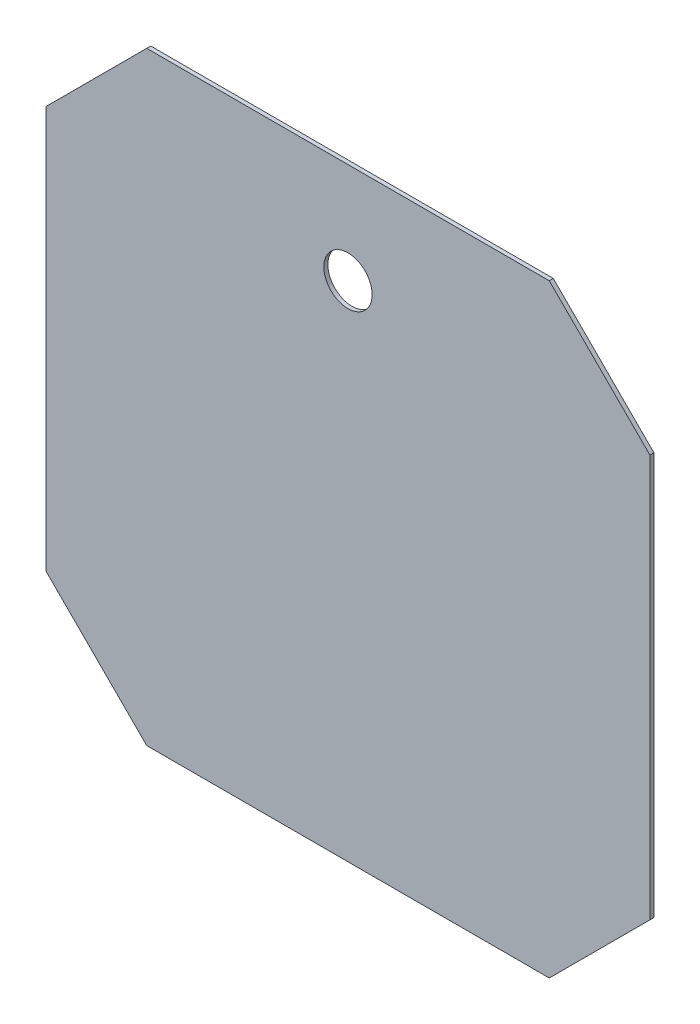
ISO-10303-21;
HEADER;
FILE_DESCRIPTION(('STEP AP214'),'2;1');
FILE_NAME('part.step','',(''),(''),'','','');
FILE_SCHEMA(('AUTOMOTIVE_DESIGN { 1 0 10303 214 1 1 1 1 }'));
ENDSEC;
DATA;
#1=APPLICATION_CONTEXT('core data for automotive mechanical design processes');
#2=APPLICATION_PROTOCOL_DEFINITION('international standard','automotive_design',2000,#1);
#3=PRODUCT_CONTEXT('',#1,'mechanical');
#4=PRODUCT('Part','Part','',(#3));
#5=PRODUCT_RELATED_PRODUCT_CATEGORY('part','',(#4));
#6=PRODUCT_DEFINITION_FORMATION('','',#4);
#7=PRODUCT_DEFINITION_CONTEXT('part definition',#1,'design');
#8=PRODUCT_DEFINITION('design','',#6,#7);
#9=PRODUCT_DEFINITION_SHAPE('','',#8);
#10=(LENGTH_UNIT() NAMED_UNIT(*) SI_UNIT(.MILLI.,.METRE.));
#11=(NAMED_UNIT(*) PLANE_ANGLE_UNIT() SI_UNIT($,.RADIAN.));
#12=(NAMED_UNIT(*) SI_UNIT($,.STERADIAN.) SOLID_ANGLE_UNIT());
#13=UNCERTAINTY_MEASURE_WITH_UNIT(LENGTH_MEASURE(1.E-05),#10,'distance_accuracy_value','');
#14=(GEOMETRIC_REPRESENTATION_CONTEXT(3) GLOBAL_UNCERTAINTY_ASSIGNED_CONTEXT((#13)) GLOBAL_UNIT_ASSIGNED_CONTEXT((#10,
#11,#12)) REPRESENTATION_CONTEXT('',''));
#15=CARTESIAN_POINT('',(0.,0.,0.));
#16=DIRECTION('',(0.,0.,1.));
#17=DIRECTION('',(1.,0.,0.));
#18=AXIS2_PLACEMENT_3D('',#15,#16,#17);
#19=CARTESIAN_POINT('',(0.,0.,1.));
#20=DIRECTION('',(0.,0.,1.));
#21=DIRECTION('',(1.,0.,0.));
#22=AXIS2_PLACEMENT_3D('',#19,#20,#21);
#23=PLANE('',#22);
#24=DIRECTION('',(0.,-1.,0.));
#25=VECTOR('',#24,1.);
#26=CARTESIAN_POINT('',(-75.,49.9999999999997,1.));
#27=LINE('',#26,#25);
#28=CARTESIAN_POINT('',(-75.,49.9999999999997,1.));
#29=VERTEX_POINT('',#28);
#30=CARTESIAN_POINT('',(-75.,-49.9999999999997,1.));
#31=VERTEX_POINT('',#30);
#32=EDGE_CURVE('E146',#29,#31,#27,.T.);
#33=ORIENTED_EDGE('',*,*,#32,.T.);
#34=DIRECTION('',(0.707106781186543,-0.707106781186552,0.));
#35=VECTOR('',#34,1.);
#36=CARTESIAN_POINT('',(-75.,-49.9999999999997,1.));
#37=LINE('',#36,#35);
#38=CARTESIAN_POINT('',(-50.,-75.,1.));
#39=VERTEX_POINT('',#38);
#40=EDGE_CURVE('E94',#31,#39,#37,.T.);
#41=ORIENTED_EDGE('',*,*,#40,.T.);
#42=DIRECTION('',(1.,0.,0.));
#43=VECTOR('',#42,1.);
#44=CARTESIAN_POINT('',(-50.,-75.,1.));
#45=LINE('',#44,#43);
#46=CARTESIAN_POINT('',(50.,-75.,1.));
#47=VERTEX_POINT('',#46);
#48=EDGE_CURVE('E161',#39,#47,#45,.T.);
#49=ORIENTED_EDGE('',*,*,#48,.T.);
#50=DIRECTION('',(0.707106781186543,0.707106781186552,0.));
#51=VECTOR('',#50,1.);
#52=CARTESIAN_POINT('',(75.,-49.9999999999997,1.));
#53=LINE('',#52,#51);
#54=CARTESIAN_POINT('',(75.,-49.9999999999997,1.));
#55=VERTEX_POINT('',#54);
#56=EDGE_CURVE('E174',#47,#55,#53,.T.);
#57=ORIENTED_EDGE('',*,*,#56,.T.);
#58=DIRECTION('',(0.,1.,0.));
#59=VECTOR('',#58,1.);
#60=CARTESIAN_POINT('',(75.,49.9999999999997,1.));
#61=LINE('',#60,#59);
#62=CARTESIAN_POINT('',(75.,49.9999999999997,1.));
#63=VERTEX_POINT('',#62);
#64=EDGE_CURVE('E113',#55,#63,#61,.T.);
#65=ORIENTED_EDGE('',*,*,#64,.T.);
#66=DIRECTION('',(-0.707106781186543,0.707106781186552,0.));
#67=VECTOR('',#66,1.);
#68=CARTESIAN_POINT('',(75.,49.9999999999997,1.));
#69=LINE('',#68,#67);
#70=CARTESIAN_POINT('',(50.,75.,1.));
#71=VERTEX_POINT('',#70);
#72=EDGE_CURVE('E107',#63,#71,#69,.T.);
#73=ORIENTED_EDGE('',*,*,#72,.T.);
#74=DIRECTION('',(-1.,0.,0.));
#75=VECTOR('',#74,1.);
#76=CARTESIAN_POINT('',(-50.,75.,1.));
#77=LINE('',#76,#75);
#78=CARTESIAN_POINT('',(-50.,75.,1.));
#79=VERTEX_POINT('',#78);
#80=EDGE_CURVE('E111',#71,#79,#77,.T.);
#81=ORIENTED_EDGE('',*,*,#80,.T.);
#82=DIRECTION('',(-0.707106781186543,-0.707106781186552,0.));
#83=VECTOR('',#82,1.);
#84=CARTESIAN_POINT('',(-75.,49.9999999999997,1.));
#85=LINE('',#84,#83);
#86=EDGE_CURVE('E51',#79,#29,#85,.T.);
#87=ORIENTED_EDGE('',*,*,#86,.T.);
#88=EDGE_LOOP('',(#33,#41,#49,#57,#65,#73,#81,#87));
#89=FACE_BOUND('',#88,.T.);
#90=CARTESIAN_POINT('',(0.,49.9999999999997,1.));
#91=DIRECTION('',(0.,0.,1.));
#92=DIRECTION('',(1.,0.,0.));
#93=AXIS2_PLACEMENT_3D('',#90,#91,#92);
#94=CIRCLE('',#93,6.);
#95=CARTESIAN_POINT('',(6.,49.9999999999997,1.));
#96=VERTEX_POINT('',#95);
#97=EDGE_CURVE('E135',#96,#96,#94,.T.);
#98=ORIENTED_EDGE('',*,*,#97,.F.);
#99=EDGE_LOOP('',(#98));
#100=FACE_BOUND('',#99,.T.);
#101=ADVANCED_FACE('F34',(#89,#100),#23,.T.);
#102=CARTESIAN_POINT('',(0.,0.,0.));
#103=DIRECTION('',(0.,0.,1.));
#104=DIRECTION('',(1.,0.,0.));
#105=AXIS2_PLACEMENT_3D('',#102,#103,#104);
#106=PLANE('',#105);
#107=DIRECTION('',(0.,-1.,0.));
#108=VECTOR('',#107,1.);
#109=CARTESIAN_POINT('',(-75.,49.9999999999997,0.));
#110=LINE('',#109,#108);
#111=CARTESIAN_POINT('',(-75.,49.9999999999997,0.));
#112=VERTEX_POINT('',#111);
#113=CARTESIAN_POINT('',(-75.,-49.9999999999997,0.));
#114=VERTEX_POINT('',#113);
#115=EDGE_CURVE('E131',#112,#114,#110,.T.);
#116=ORIENTED_EDGE('',*,*,#115,.F.);
#117=DIRECTION('',(-0.707106781186543,-0.707106781186552,0.));
#118=VECTOR('',#117,1.);
#119=CARTESIAN_POINT('',(-75.,49.9999999999997,0.));
#120=LINE('',#119,#118);
#121=CARTESIAN_POINT('',(-50.,75.,0.));
#122=VERTEX_POINT('',#121);
#123=EDGE_CURVE('E86',#122,#112,#120,.T.);
#124=ORIENTED_EDGE('',*,*,#123,.F.);
#125=DIRECTION('',(-1.,0.,0.));
#126=VECTOR('',#125,1.);
#127=CARTESIAN_POINT('',(-50.,75.,0.));
#128=LINE('',#127,#126);
#129=CARTESIAN_POINT('',(50.,75.,0.));
#130=VERTEX_POINT('',#129);
#131=EDGE_CURVE('E80',#130,#122,#128,.T.);
#132=ORIENTED_EDGE('',*,*,#131,.F.);
#133=DIRECTION('',(-0.707106781186543,0.707106781186552,0.));
#134=VECTOR('',#133,1.);
#135=CARTESIAN_POINT('',(75.,49.9999999999997,0.));
#136=LINE('',#135,#134);
#137=CARTESIAN_POINT('',(75.,49.9999999999997,0.));
#138=VERTEX_POINT('',#137);
#139=EDGE_CURVE('E121',#138,#130,#136,.T.);
#140=ORIENTED_EDGE('',*,*,#139,.F.);
#141=DIRECTION('',(0.,1.,0.));
#142=VECTOR('',#141,1.);
#143=CARTESIAN_POINT('',(75.,49.9999999999997,0.));
#144=LINE('',#143,#142);
#145=CARTESIAN_POINT('',(75.,-49.9999999999997,0.));
#146=VERTEX_POINT('',#145);
#147=EDGE_CURVE('E141',#146,#138,#144,.T.);
#148=ORIENTED_EDGE('',*,*,#147,.F.);
#149=DIRECTION('',(0.707106781186543,0.707106781186552,0.));
#150=VECTOR('',#149,1.);
#151=CARTESIAN_POINT('',(75.,-49.9999999999997,0.));
#152=LINE('',#151,#150);
#153=CARTESIAN_POINT('',(50.,-75.,0.));
#154=VERTEX_POINT('',#153);
#155=EDGE_CURVE('E139',#154,#146,#152,.T.);
#156=ORIENTED_EDGE('',*,*,#155,.F.);
#157=DIRECTION('',(1.,0.,0.));
#158=VECTOR('',#157,1.);
#159=CARTESIAN_POINT('',(-50.,-75.,0.));
#160=LINE('',#159,#158);
#161=CARTESIAN_POINT('',(-50.,-75.,0.));
#162=VERTEX_POINT('',#161);
#163=EDGE_CURVE('E137',#162,#154,#160,.T.);
#164=ORIENTED_EDGE('',*,*,#163,.F.);
#165=DIRECTION('',(0.707106781186543,-0.707106781186552,0.));
#166=VECTOR('',#165,1.);
#167=CARTESIAN_POINT('',(-75.,-49.9999999999997,0.));
#168=LINE('',#167,#166);
#169=EDGE_CURVE('E134',#114,#162,#168,.T.);
#170=ORIENTED_EDGE('',*,*,#169,.F.);
#171=EDGE_LOOP('',(#116,#124,#132,#140,#148,#156,#164,#170));
#172=FACE_BOUND('',#171,.T.);
#173=CARTESIAN_POINT('',(0.,49.9999999999997,0.));
#174=DIRECTION('',(0.,0.,1.));
#175=DIRECTION('',(1.,0.,0.));
#176=AXIS2_PLACEMENT_3D('',#173,#174,#175);
#177=CIRCLE('',#176,6.);
#178=CARTESIAN_POINT('',(6.,49.9999999999997,0.));
#179=VERTEX_POINT('',#178);
#180=EDGE_CURVE('E180',#179,#179,#177,.T.);
#181=ORIENTED_EDGE('',*,*,#180,.T.);
#182=EDGE_LOOP('',(#181));
#183=FACE_BOUND('',#182,.T.);
#184=ADVANCED_FACE('F165',(#172,#183),#106,.F.);
#185=CARTESIAN_POINT('',(-75.,49.9999999999997,1.));
#186=DIRECTION('',(1.,0.,0.));
#187=DIRECTION('',(0.,0.,-1.));
#188=AXIS2_PLACEMENT_3D('',#185,#186,#187);
#189=PLANE('',#188);
#190=ORIENTED_EDGE('',*,*,#115,.T.);
#191=DIRECTION('',(0.,0.,-1.));
#192=VECTOR('',#191,1.);
#193=CARTESIAN_POINT('',(-75.,-49.9999999999997,1.));
#194=LINE('',#193,#192);
#195=EDGE_CURVE('E11',#31,#114,#194,.T.);
#196=ORIENTED_EDGE('',*,*,#195,.F.);
#197=ORIENTED_EDGE('',*,*,#32,.F.);
#198=DIRECTION('',(0.,0.,-1.));
#199=VECTOR('',#198,1.);
#200=CARTESIAN_POINT('',(-75.,49.9999999999997,1.));
#201=LINE('',#200,#199);
#202=EDGE_CURVE('E127',#29,#112,#201,.T.);
#203=ORIENTED_EDGE('',*,*,#202,.T.);
#204=EDGE_LOOP('',(#190,#196,#197,#203));
#205=FACE_BOUND('',#204,.T.);
#206=ADVANCED_FACE('F36',(#205),#189,.F.);
#207=CARTESIAN_POINT('',(-75.,-49.9999999999997,1.));
#208=DIRECTION('',(0.707106781186552,0.707106781186543,0.));
#209=DIRECTION('',(-0.707106781186543,0.707106781186552,0.));
#210=AXIS2_PLACEMENT_3D('',#207,#208,#209);
#211=PLANE('',#210);
#212=ORIENTED_EDGE('',*,*,#169,.T.);
#213=DIRECTION('',(0.,0.,-1.));
#214=VECTOR('',#213,1.);
#215=CARTESIAN_POINT('',(-50.,-75.,1.));
#216=LINE('',#215,#214);
#217=EDGE_CURVE('E43',#39,#162,#216,.T.);
#218=ORIENTED_EDGE('',*,*,#217,.F.);
#219=ORIENTED_EDGE('',*,*,#40,.F.);
#220=ORIENTED_EDGE('',*,*,#195,.T.);
#221=EDGE_LOOP('',(#212,#218,#219,#220));
#222=FACE_BOUND('',#221,.T.);
#223=ADVANCED_FACE('F208',(#222),#211,.F.);
#224=CARTESIAN_POINT('',(-50.,-75.,1.));
#225=DIRECTION('',(0.,1.,0.));
#226=DIRECTION('',(0.,0.,1.));
#227=AXIS2_PLACEMENT_3D('',#224,#225,#226);
#228=PLANE('',#227);
#229=ORIENTED_EDGE('',*,*,#163,.T.);
#230=DIRECTION('',(0.,0.,-1.));
#231=VECTOR('',#230,1.);
#232=CARTESIAN_POINT('',(50.,-75.,1.));
#233=LINE('',#232,#231);
#234=EDGE_CURVE('E153',#47,#154,#233,.T.);
#235=ORIENTED_EDGE('',*,*,#234,.F.);
#236=ORIENTED_EDGE('',*,*,#48,.F.);
#237=ORIENTED_EDGE('',*,*,#217,.T.);
#238=EDGE_LOOP('',(#229,#235,#236,#237));
#239=FACE_BOUND('',#238,.T.);
#240=ADVANCED_FACE('F159',(#239),#228,.F.);
#241=CARTESIAN_POINT('',(75.,-49.9999999999997,1.));
#242=DIRECTION('',(-0.707106781186552,0.707106781186543,0.));
#243=DIRECTION('',(-0.707106781186543,-0.707106781186552,0.));
#244=AXIS2_PLACEMENT_3D('',#241,#242,#243);
#245=PLANE('',#244);
#246=ORIENTED_EDGE('',*,*,#155,.T.);
#247=DIRECTION('',(0.,0.,-1.));
#248=VECTOR('',#247,1.);
#249=CARTESIAN_POINT('',(75.,-49.9999999999997,1.));
#250=LINE('',#249,#248);
#251=EDGE_CURVE('E150',#55,#146,#250,.T.);
#252=ORIENTED_EDGE('',*,*,#251,.F.);
#253=ORIENTED_EDGE('',*,*,#56,.F.);
#254=ORIENTED_EDGE('',*,*,#234,.T.);
#255=EDGE_LOOP('',(#246,#252,#253,#254));
#256=FACE_BOUND('',#255,.T.);
#257=ADVANCED_FACE('F170',(#256),#245,.F.);
#258=CARTESIAN_POINT('',(75.,49.9999999999997,1.));
#259=DIRECTION('',(-1.,0.,0.));
#260=DIRECTION('',(0.,0.,1.));
#261=AXIS2_PLACEMENT_3D('',#258,#259,#260);
#262=PLANE('',#261);
#263=ORIENTED_EDGE('',*,*,#147,.T.);
#264=DIRECTION('',(0.,0.,-1.));
#265=VECTOR('',#264,1.);
#266=CARTESIAN_POINT('',(75.,49.9999999999997,1.));
#267=LINE('',#266,#265);
#268=EDGE_CURVE('E122',#63,#138,#267,.T.);
#269=ORIENTED_EDGE('',*,*,#268,.F.);
#270=ORIENTED_EDGE('',*,*,#64,.F.);
#271=ORIENTED_EDGE('',*,*,#251,.T.);
#272=EDGE_LOOP('',(#263,#269,#270,#271));
#273=FACE_BOUND('',#272,.T.);
#274=ADVANCED_FACE('F173',(#273),#262,.F.);
#275=CARTESIAN_POINT('',(75.,49.9999999999997,1.));
#276=DIRECTION('',(-0.707106781186552,-0.707106781186543,0.));
#277=DIRECTION('',(0.707106781186543,-0.707106781186552,0.));
#278=AXIS2_PLACEMENT_3D('',#275,#276,#277);
#279=PLANE('',#278);
#280=ORIENTED_EDGE('',*,*,#139,.T.);
#281=DIRECTION('',(0.,0.,-1.));
#282=VECTOR('',#281,1.);
#283=CARTESIAN_POINT('',(50.,75.,1.));
#284=LINE('',#283,#282);
#285=EDGE_CURVE('E118',#71,#130,#284,.T.);
#286=ORIENTED_EDGE('',*,*,#285,.F.);
#287=ORIENTED_EDGE('',*,*,#72,.F.);
#288=ORIENTED_EDGE('',*,*,#268,.T.);
#289=EDGE_LOOP('',(#280,#286,#287,#288));
#290=FACE_BOUND('',#289,.T.);
#291=ADVANCED_FACE('F119',(#290),#279,.F.);
#292=CARTESIAN_POINT('',(-50.,75.,1.));
#293=DIRECTION('',(0.,-1.,0.));
#294=DIRECTION('',(0.,0.,-1.));
#295=AXIS2_PLACEMENT_3D('',#292,#293,#294);
#296=PLANE('',#295);
#297=ORIENTED_EDGE('',*,*,#131,.T.);
#298=DIRECTION('',(0.,0.,-1.));
#299=VECTOR('',#298,1.);
#300=CARTESIAN_POINT('',(-50.,75.,1.));
#301=LINE('',#300,#299);
#302=EDGE_CURVE('E123',#79,#122,#301,.T.);
#303=ORIENTED_EDGE('',*,*,#302,.F.);
#304=ORIENTED_EDGE('',*,*,#80,.F.);
#305=ORIENTED_EDGE('',*,*,#285,.T.);
#306=EDGE_LOOP('',(#297,#303,#304,#305));
#307=FACE_BOUND('',#306,.T.);
#308=ADVANCED_FACE('F125',(#307),#296,.F.);
#309=CARTESIAN_POINT('',(-75.,49.9999999999997,1.));
#310=DIRECTION('',(0.707106781186552,-0.707106781186543,0.));
#311=DIRECTION('',(0.707106781186543,0.707106781186552,0.));
#312=AXIS2_PLACEMENT_3D('',#309,#310,#311);
#313=PLANE('',#312);
#314=ORIENTED_EDGE('',*,*,#123,.T.);
#315=ORIENTED_EDGE('',*,*,#202,.F.);
#316=ORIENTED_EDGE('',*,*,#86,.F.);
#317=ORIENTED_EDGE('',*,*,#302,.T.);
#318=EDGE_LOOP('',(#314,#315,#316,#317));
#319=FACE_BOUND('',#318,.T.);
#320=ADVANCED_FACE('F196',(#319),#313,.F.);
#321=CARTESIAN_POINT('',(0.,49.9999999999997,1.));
#322=DIRECTION('',(0.,0.,-1.));
#323=DIRECTION('',(-1.,0.,0.));
#324=AXIS2_PLACEMENT_3D('',#321,#322,#323);
#325=CYLINDRICAL_SURFACE('',#324,6.);
#326=ORIENTED_EDGE('',*,*,#97,.T.);
#327=EDGE_LOOP('',(#326));
#328=FACE_BOUND('',#327,.T.);
#329=ORIENTED_EDGE('',*,*,#180,.F.);
#330=EDGE_LOOP('',(#329));
#331=FACE_BOUND('',#330,.T.);
#332=ADVANCED_FACE('F186',(#328,#331),#325,.F.);
#333=CLOSED_SHELL('',(#101,#184,#206,#223,#240,#257,#274,#291,#308,#320,#332));
#334=MANIFOLD_SOLID_BREP('B2',#333);
#335=ADVANCED_BREP_SHAPE_REPRESENTATION('',(#18,#334),#14);
#336=SHAPE_DEFINITION_REPRESENTATION(#9,#335);
ENDSEC;
END-ISO-10303-21;
